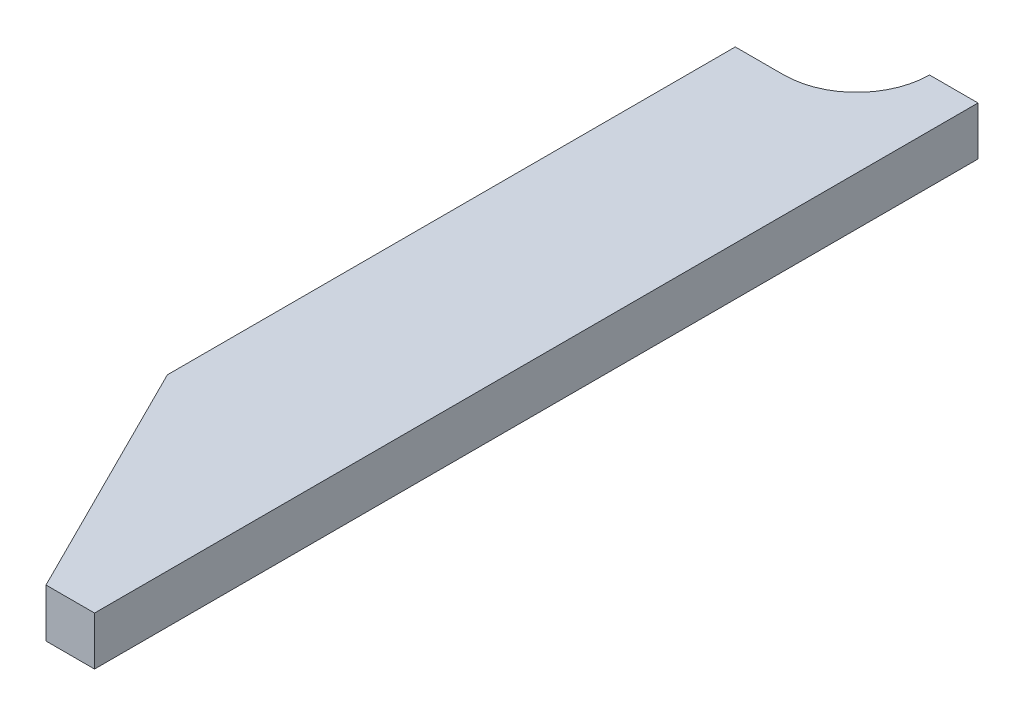
ISO-10303-21;
HEADER;
FILE_DESCRIPTION(('STEP AP214'),'2;1');
FILE_NAME('part.step','',(''),(''),'','','');
FILE_SCHEMA(('AUTOMOTIVE_DESIGN { 1 0 10303 214 1 1 1 1 }'));
ENDSEC;
DATA;
#1=APPLICATION_CONTEXT('core data for automotive mechanical design processes');
#2=APPLICATION_PROTOCOL_DEFINITION('international standard','automotive_design',2000,#1);
#3=PRODUCT_CONTEXT('',#1,'mechanical');
#4=PRODUCT('Part','Part','',(#3));
#5=PRODUCT_RELATED_PRODUCT_CATEGORY('part','',(#4));
#6=PRODUCT_DEFINITION_FORMATION('','',#4);
#7=PRODUCT_DEFINITION_CONTEXT('part definition',#1,'design');
#8=PRODUCT_DEFINITION('design','',#6,#7);
#9=PRODUCT_DEFINITION_SHAPE('','',#8);
#10=(LENGTH_UNIT() NAMED_UNIT(*) SI_UNIT(.MILLI.,.METRE.));
#11=(NAMED_UNIT(*) PLANE_ANGLE_UNIT() SI_UNIT($,.RADIAN.));
#12=(NAMED_UNIT(*) SI_UNIT($,.STERADIAN.) SOLID_ANGLE_UNIT());
#13=UNCERTAINTY_MEASURE_WITH_UNIT(LENGTH_MEASURE(1.E-05),#10,'distance_accuracy_value','');
#14=(GEOMETRIC_REPRESENTATION_CONTEXT(3) GLOBAL_UNCERTAINTY_ASSIGNED_CONTEXT((#13)) GLOBAL_UNIT_ASSIGNED_CONTEXT((#10,
#11,#12)) REPRESENTATION_CONTEXT('',''));
#15=CARTESIAN_POINT('',(0.,0.,0.));
#16=DIRECTION('',(0.,0.,1.));
#17=DIRECTION('',(1.,0.,0.));
#18=AXIS2_PLACEMENT_3D('',#15,#16,#17);
#19=CARTESIAN_POINT('',(-3.195,1.67999999999,1.255));
#20=DIRECTION('',(0.,1.,0.));
#21=DIRECTION('',(-1.,0.,0.));
#22=AXIS2_PLACEMENT_3D('',#19,#20,#21);
#23=PLANE('',#22);
#24=DIRECTION('',(0.,0.,1.));
#25=VECTOR('',#24,1.);
#26=CARTESIAN_POINT('',(-3.295,1.67999999999,1.255));
#27=LINE('',#26,#25);
#28=CARTESIAN_POINT('',(-3.295,1.67999999999,1.405));
#29=VERTEX_POINT('',#28);
#30=CARTESIAN_POINT('',(-3.295,1.67999999999,2.575));
#31=VERTEX_POINT('',#30);
#32=EDGE_CURVE('E91',#29,#31,#27,.T.);
#33=ORIENTED_EDGE('',*,*,#32,.F.);
#34=DIRECTION('',(-1.,0.,0.));
#35=VECTOR('',#34,1.);
#36=CARTESIAN_POINT('',(-3.195,1.67999999999,1.405));
#37=LINE('',#36,#35);
#38=CARTESIAN_POINT('',(-3.195,1.67999999999,1.405));
#39=VERTEX_POINT('',#38);
#40=EDGE_CURVE('E83',#39,#29,#37,.T.);
#41=ORIENTED_EDGE('',*,*,#40,.F.);
#42=CARTESIAN_POINT('',(-3.195,1.67999999999,1.255));
#43=DIRECTION('',(0.,1.,0.));
#44=DIRECTION('',(-1.,0.,0.));
#45=AXIS2_PLACEMENT_3D('',#42,#43,#44);
#46=CIRCLE('',#45,0.15);
#47=CARTESIAN_POINT('',(-3.045,1.67999999999,1.255));
#48=VERTEX_POINT('',#47);
#49=EDGE_CURVE('E19',#48,#39,#46,.F.);
#50=ORIENTED_EDGE('',*,*,#49,.F.);
#51=DIRECTION('',(-1.,0.,0.));
#52=VECTOR('',#51,1.);
#53=CARTESIAN_POINT('',(-3.195,1.67999999999,1.255));
#54=LINE('',#53,#52);
#55=CARTESIAN_POINT('',(-2.945,1.67999999999,1.255));
#56=VERTEX_POINT('',#55);
#57=EDGE_CURVE('E71',#56,#48,#54,.T.);
#58=ORIENTED_EDGE('',*,*,#57,.F.);
#59=DIRECTION('',(0.,0.,1.));
#60=VECTOR('',#59,1.);
#61=CARTESIAN_POINT('',(-2.945,1.67999999999,3.075));
#62=LINE('',#61,#60);
#63=CARTESIAN_POINT('',(-2.945,1.67999999999,3.075));
#64=VERTEX_POINT('',#63);
#65=EDGE_CURVE('E136',#56,#64,#62,.T.);
#66=ORIENTED_EDGE('',*,*,#65,.T.);
#67=DIRECTION('',(-1.,0.,0.));
#68=VECTOR('',#67,1.);
#69=CARTESIAN_POINT('',(-3.045,1.67999999999,3.075));
#70=LINE('',#69,#68);
#71=CARTESIAN_POINT('',(-3.045,1.67999999999,3.075));
#72=VERTEX_POINT('',#71);
#73=EDGE_CURVE('E145',#64,#72,#70,.T.);
#74=ORIENTED_EDGE('',*,*,#73,.T.);
#75=DIRECTION('',(-0.447213595499958,0.,-0.894427190999916));
#76=VECTOR('',#75,1.);
#77=CARTESIAN_POINT('',(-3.045,1.67999999999,3.075));
#78=LINE('',#77,#76);
#79=EDGE_CURVE('E93',#72,#31,#78,.T.);
#80=ORIENTED_EDGE('',*,*,#79,.T.);
#81=EDGE_LOOP('',(#33,#41,#50,#58,#66,#74,#80));
#82=FACE_BOUND('',#81,.T.);
#83=ADVANCED_FACE('F16',(#82),#23,.F.);
#84=CARTESIAN_POINT('',(-3.045,1.67999999999,3.075));
#85=DIRECTION('',(0.894427190999916,0.,-0.447213595499958));
#86=DIRECTION('',(-0.447213595499958,0.,-0.894427190999916));
#87=AXIS2_PLACEMENT_3D('',#84,#85,#86);
#88=PLANE('',#87);
#89=DIRECTION('',(0.,1.,0.));
#90=VECTOR('',#89,1.);
#91=CARTESIAN_POINT('',(-3.295,1.67999999999,2.575));
#92=LINE('',#91,#90);
#93=CARTESIAN_POINT('',(-3.295,1.77999999999,2.575));
#94=VERTEX_POINT('',#93);
#95=EDGE_CURVE('E87',#94,#31,#92,.F.);
#96=ORIENTED_EDGE('',*,*,#95,.T.);
#97=ORIENTED_EDGE('',*,*,#79,.F.);
#98=DIRECTION('',(0.,1.,0.));
#99=VECTOR('',#98,1.);
#100=CARTESIAN_POINT('',(-3.045,1.67999999999,3.075));
#101=LINE('',#100,#99);
#102=CARTESIAN_POINT('',(-3.045,1.77999999999,3.075));
#103=VERTEX_POINT('',#102);
#104=EDGE_CURVE('E143',#72,#103,#101,.T.);
#105=ORIENTED_EDGE('',*,*,#104,.T.);
#106=DIRECTION('',(0.447213595499958,0.,0.894427190999916));
#107=VECTOR('',#106,1.);
#108=CARTESIAN_POINT('',(-3.295,1.77999999999,2.575));
#109=LINE('',#108,#107);
#110=EDGE_CURVE('E124',#94,#103,#109,.T.);
#111=ORIENTED_EDGE('',*,*,#110,.F.);
#112=EDGE_LOOP('',(#96,#97,#105,#111));
#113=FACE_BOUND('',#112,.T.);
#114=ADVANCED_FACE('F168',(#113),#88,.F.);
#115=CARTESIAN_POINT('',(-3.045,1.67999999999,3.075));
#116=DIRECTION('',(0.,0.,-1.));
#117=DIRECTION('',(-1.,0.,0.));
#118=AXIS2_PLACEMENT_3D('',#115,#116,#117);
#119=PLANE('',#118);
#120=ORIENTED_EDGE('',*,*,#104,.F.);
#121=ORIENTED_EDGE('',*,*,#73,.F.);
#122=DIRECTION('',(0.,1.,0.));
#123=VECTOR('',#122,1.);
#124=CARTESIAN_POINT('',(-2.945,1.67999999999,3.075));
#125=LINE('',#124,#123);
#126=CARTESIAN_POINT('',(-2.945,1.77999999999,3.075));
#127=VERTEX_POINT('',#126);
#128=EDGE_CURVE('E130',#64,#127,#125,.T.);
#129=ORIENTED_EDGE('',*,*,#128,.T.);
#130=DIRECTION('',(-1.,0.,0.));
#131=VECTOR('',#130,1.);
#132=CARTESIAN_POINT('',(-3.195,1.77999999999,3.075));
#133=LINE('',#132,#131);
#134=EDGE_CURVE('E114',#103,#127,#133,.F.);
#135=ORIENTED_EDGE('',*,*,#134,.F.);
#136=EDGE_LOOP('',(#120,#121,#129,#135));
#137=FACE_BOUND('',#136,.T.);
#138=ADVANCED_FACE('F171',(#137),#119,.F.);
#139=CARTESIAN_POINT('',(-2.945,1.67999999999,3.075));
#140=DIRECTION('',(-1.,0.,0.));
#141=DIRECTION('',(0.,0.,1.));
#142=AXIS2_PLACEMENT_3D('',#139,#140,#141);
#143=PLANE('',#142);
#144=ORIENTED_EDGE('',*,*,#128,.F.);
#145=ORIENTED_EDGE('',*,*,#65,.F.);
#146=DIRECTION('',(0.,1.,0.));
#147=VECTOR('',#146,1.);
#148=CARTESIAN_POINT('',(-2.945,1.67999999999,1.255));
#149=LINE('',#148,#147);
#150=CARTESIAN_POINT('',(-2.945,1.77999999999,1.255));
#151=VERTEX_POINT('',#150);
#152=EDGE_CURVE('E128',#56,#151,#149,.T.);
#153=ORIENTED_EDGE('',*,*,#152,.T.);
#154=DIRECTION('',(0.,0.,1.));
#155=VECTOR('',#154,1.);
#156=CARTESIAN_POINT('',(-2.945,1.77999999999,1.255));
#157=LINE('',#156,#155);
#158=EDGE_CURVE('E110',#127,#151,#157,.F.);
#159=ORIENTED_EDGE('',*,*,#158,.F.);
#160=EDGE_LOOP('',(#144,#145,#153,#159));
#161=FACE_BOUND('',#160,.T.);
#162=ADVANCED_FACE('F191',(#161),#143,.F.);
#163=CARTESIAN_POINT('',(-2.945,1.67999999999,1.255));
#164=DIRECTION('',(0.,0.,1.));
#165=DIRECTION('',(1.,0.,0.));
#166=AXIS2_PLACEMENT_3D('',#163,#164,#165);
#167=PLANE('',#166);
#168=ORIENTED_EDGE('',*,*,#152,.F.);
#169=ORIENTED_EDGE('',*,*,#57,.T.);
#170=DIRECTION('',(0.,1.,0.));
#171=VECTOR('',#170,1.);
#172=CARTESIAN_POINT('',(-3.045,1.67999999999,1.255));
#173=LINE('',#172,#171);
#174=CARTESIAN_POINT('',(-3.045,1.77999999999,1.255));
#175=VERTEX_POINT('',#174);
#176=EDGE_CURVE('E80',#48,#175,#173,.T.);
#177=ORIENTED_EDGE('',*,*,#176,.T.);
#178=DIRECTION('',(-1.,0.,0.));
#179=VECTOR('',#178,1.);
#180=CARTESIAN_POINT('',(-3.195,1.77999999999,1.255));
#181=LINE('',#180,#179);
#182=EDGE_CURVE('E106',#151,#175,#181,.T.);
#183=ORIENTED_EDGE('',*,*,#182,.F.);
#184=EDGE_LOOP('',(#168,#169,#177,#183));
#185=FACE_BOUND('',#184,.T.);
#186=ADVANCED_FACE('F188',(#185),#167,.F.);
#187=CARTESIAN_POINT('',(-3.195,1.67999999999,1.255));
#188=DIRECTION('',(0.,1.,0.));
#189=DIRECTION('',(-1.,0.,0.));
#190=AXIS2_PLACEMENT_3D('',#187,#188,#189);
#191=CYLINDRICAL_SURFACE('',#190,0.15);
#192=ORIENTED_EDGE('',*,*,#176,.F.);
#193=ORIENTED_EDGE('',*,*,#49,.T.);
#194=DIRECTION('',(0.,1.,0.));
#195=VECTOR('',#194,1.);
#196=CARTESIAN_POINT('',(-3.195,1.67999999999,1.405));
#197=LINE('',#196,#195);
#198=CARTESIAN_POINT('',(-3.195,1.77999999999,1.405));
#199=VERTEX_POINT('',#198);
#200=EDGE_CURVE('E79',#39,#199,#197,.T.);
#201=ORIENTED_EDGE('',*,*,#200,.T.);
#202=CARTESIAN_POINT('',(-3.195,1.77999999999,1.255));
#203=DIRECTION('',(0.,1.,0.));
#204=DIRECTION('',(-1.,0.,0.));
#205=AXIS2_PLACEMENT_3D('',#202,#203,#204);
#206=CIRCLE('',#205,0.15);
#207=EDGE_CURVE('E105',#175,#199,#206,.F.);
#208=ORIENTED_EDGE('',*,*,#207,.F.);
#209=EDGE_LOOP('',(#192,#193,#201,#208));
#210=FACE_BOUND('',#209,.T.);
#211=ADVANCED_FACE('F77',(#210),#191,.F.);
#212=CARTESIAN_POINT('',(-3.195,1.67999999999,1.405));
#213=DIRECTION('',(0.,0.,1.));
#214=DIRECTION('',(1.,0.,0.));
#215=AXIS2_PLACEMENT_3D('',#212,#213,#214);
#216=PLANE('',#215);
#217=ORIENTED_EDGE('',*,*,#200,.F.);
#218=ORIENTED_EDGE('',*,*,#40,.T.);
#219=DIRECTION('',(0.,1.,0.));
#220=VECTOR('',#219,1.);
#221=CARTESIAN_POINT('',(-3.295,1.67999999999,1.405));
#222=LINE('',#221,#220);
#223=CARTESIAN_POINT('',(-3.295,1.77999999999,1.405));
#224=VERTEX_POINT('',#223);
#225=EDGE_CURVE('E34',#29,#224,#222,.T.);
#226=ORIENTED_EDGE('',*,*,#225,.T.);
#227=DIRECTION('',(-1.,0.,0.));
#228=VECTOR('',#227,1.);
#229=CARTESIAN_POINT('',(-3.195,1.77999999999,1.405));
#230=LINE('',#229,#228);
#231=EDGE_CURVE('E25',#199,#224,#230,.T.);
#232=ORIENTED_EDGE('',*,*,#231,.F.);
#233=EDGE_LOOP('',(#217,#218,#226,#232));
#234=FACE_BOUND('',#233,.T.);
#235=ADVANCED_FACE('F84',(#234),#216,.F.);
#236=CARTESIAN_POINT('',(-3.295,1.67999999999,1.405));
#237=DIRECTION('',(1.,0.,0.));
#238=DIRECTION('',(0.,0.,-1.));
#239=AXIS2_PLACEMENT_3D('',#236,#237,#238);
#240=PLANE('',#239);
#241=ORIENTED_EDGE('',*,*,#225,.F.);
#242=ORIENTED_EDGE('',*,*,#32,.T.);
#243=ORIENTED_EDGE('',*,*,#95,.F.);
#244=DIRECTION('',(0.,0.,1.));
#245=VECTOR('',#244,1.);
#246=CARTESIAN_POINT('',(-3.295,1.77999999999,1.255));
#247=LINE('',#246,#245);
#248=EDGE_CURVE('E11',#224,#94,#247,.T.);
#249=ORIENTED_EDGE('',*,*,#248,.F.);
#250=EDGE_LOOP('',(#241,#242,#243,#249));
#251=FACE_BOUND('',#250,.T.);
#252=ADVANCED_FACE('F175',(#251),#240,.F.);
#253=CARTESIAN_POINT('',(-3.195,1.77999999999,1.255));
#254=DIRECTION('',(0.,1.,0.));
#255=DIRECTION('',(-1.,0.,0.));
#256=AXIS2_PLACEMENT_3D('',#253,#254,#255);
#257=PLANE('',#256);
#258=ORIENTED_EDGE('',*,*,#231,.T.);
#259=ORIENTED_EDGE('',*,*,#248,.T.);
#260=ORIENTED_EDGE('',*,*,#110,.T.);
#261=ORIENTED_EDGE('',*,*,#134,.T.);
#262=ORIENTED_EDGE('',*,*,#158,.T.);
#263=ORIENTED_EDGE('',*,*,#182,.T.);
#264=ORIENTED_EDGE('',*,*,#207,.T.);
#265=EDGE_LOOP('',(#258,#259,#260,#261,#262,#263,#264));
#266=FACE_BOUND('',#265,.T.);
#267=ADVANCED_FACE('F173',(#266),#257,.T.);
#268=CLOSED_SHELL('',(#83,#114,#138,#162,#186,#211,#235,#252,#267));
#269=MANIFOLD_SOLID_BREP('B1',#268);
#270=ADVANCED_BREP_SHAPE_REPRESENTATION('',(#18,#269),#14);
#271=SHAPE_DEFINITION_REPRESENTATION(#9,#270);
ENDSEC;
END-ISO-10303-21;
